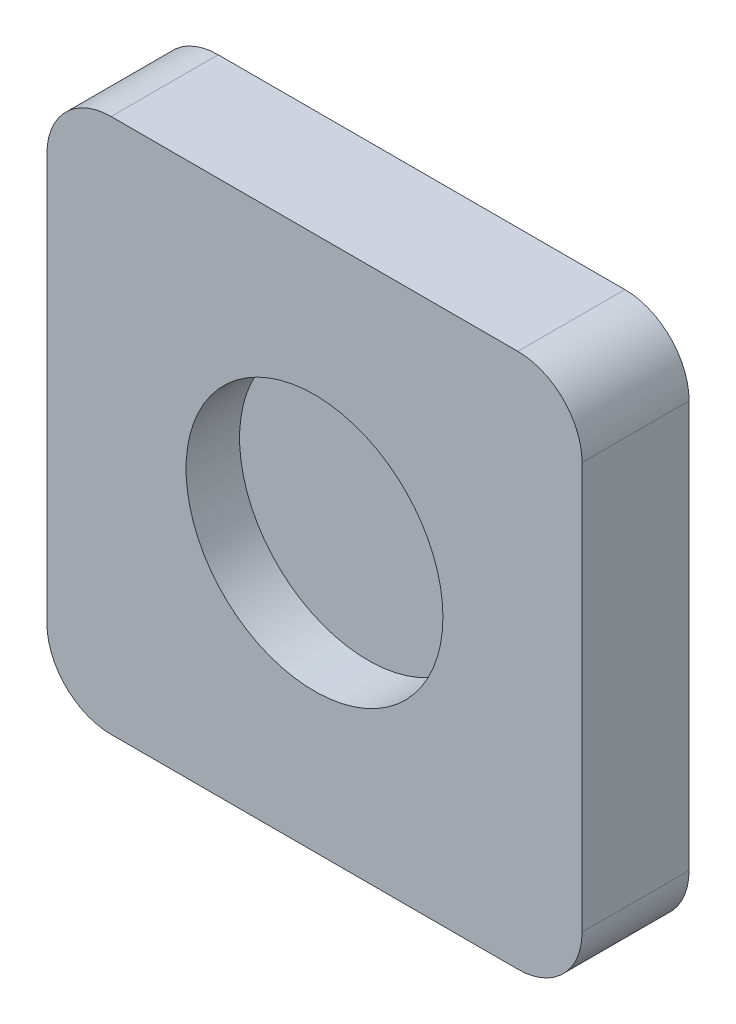
ISO-10303-21;
HEADER;
FILE_DESCRIPTION(('STEP AP214'),'2;1');
FILE_NAME('part.step','',(''),(''),'','','');
FILE_SCHEMA(('AUTOMOTIVE_DESIGN { 1 0 10303 214 1 1 1 1 }'));
ENDSEC;
DATA;
#1=APPLICATION_CONTEXT('core data for automotive mechanical design processes');
#2=APPLICATION_PROTOCOL_DEFINITION('international standard','automotive_design',2000,#1);
#3=PRODUCT_CONTEXT('',#1,'mechanical');
#4=PRODUCT('Part','Part','',(#3));
#5=PRODUCT_RELATED_PRODUCT_CATEGORY('part','',(#4));
#6=PRODUCT_DEFINITION_FORMATION('','',#4);
#7=PRODUCT_DEFINITION_CONTEXT('part definition',#1,'design');
#8=PRODUCT_DEFINITION('design','',#6,#7);
#9=PRODUCT_DEFINITION_SHAPE('','',#8);
#10=(LENGTH_UNIT() NAMED_UNIT(*) SI_UNIT(.MILLI.,.METRE.));
#11=(NAMED_UNIT(*) PLANE_ANGLE_UNIT() SI_UNIT($,.RADIAN.));
#12=(NAMED_UNIT(*) SI_UNIT($,.STERADIAN.) SOLID_ANGLE_UNIT());
#13=UNCERTAINTY_MEASURE_WITH_UNIT(LENGTH_MEASURE(1.E-05),#10,'distance_accuracy_value','');
#14=(GEOMETRIC_REPRESENTATION_CONTEXT(3) GLOBAL_UNCERTAINTY_ASSIGNED_CONTEXT((#13)) GLOBAL_UNIT_ASSIGNED_CONTEXT((#10,
#11,#12)) REPRESENTATION_CONTEXT('',''));
#15=CARTESIAN_POINT('',(0.,0.,0.));
#16=DIRECTION('',(0.,0.,1.));
#17=DIRECTION('',(1.,0.,0.));
#18=AXIS2_PLACEMENT_3D('',#15,#16,#17);
#19=CARTESIAN_POINT('',(-0.095,-0.095,0.05));
#20=DIRECTION('',(0.,0.,-1.));
#21=DIRECTION('',(-1.,0.,0.));
#22=AXIS2_PLACEMENT_3D('',#19,#20,#21);
#23=CYLINDRICAL_SURFACE('',#22,0.03);
#24=CARTESIAN_POINT('',(-0.095,-0.095,0.));
#25=DIRECTION('',(0.,0.,1.));
#26=DIRECTION('',(1.,0.,0.));
#27=AXIS2_PLACEMENT_3D('',#24,#25,#26);
#28=CIRCLE('',#27,0.03);
#29=CARTESIAN_POINT('',(-0.125,-0.095,0.));
#30=VERTEX_POINT('',#29);
#31=CARTESIAN_POINT('',(-0.095,-0.125,0.));
#32=VERTEX_POINT('',#31);
#33=EDGE_CURVE('E139',#30,#32,#28,.T.);
#34=ORIENTED_EDGE('',*,*,#33,.T.);
#35=DIRECTION('',(0.,0.,-1.));
#36=VECTOR('',#35,1.);
#37=CARTESIAN_POINT('',(-0.095,-0.125,0.05));
#38=LINE('',#37,#36);
#39=CARTESIAN_POINT('',(-0.095,-0.125,0.05));
#40=VERTEX_POINT('',#39);
#41=EDGE_CURVE('E11',#40,#32,#38,.T.);
#42=ORIENTED_EDGE('',*,*,#41,.F.);
#43=CARTESIAN_POINT('',(-0.095,-0.095,0.05));
#44=DIRECTION('',(0.,0.,1.));
#45=DIRECTION('',(1.,0.,0.));
#46=AXIS2_PLACEMENT_3D('',#43,#44,#45);
#47=CIRCLE('',#46,0.03);
#48=CARTESIAN_POINT('',(-0.125,-0.095,0.05));
#49=VERTEX_POINT('',#48);
#50=EDGE_CURVE('E162',#49,#40,#47,.T.);
#51=ORIENTED_EDGE('',*,*,#50,.F.);
#52=DIRECTION('',(0.,0.,-1.));
#53=VECTOR('',#52,1.);
#54=CARTESIAN_POINT('',(-0.125,-0.095,0.05));
#55=LINE('',#54,#53);
#56=EDGE_CURVE('E135',#49,#30,#55,.T.);
#57=ORIENTED_EDGE('',*,*,#56,.T.);
#58=EDGE_LOOP('',(#34,#42,#51,#57));
#59=FACE_BOUND('',#58,.T.);
#60=ADVANCED_FACE('F38',(#59),#23,.T.);
#61=CARTESIAN_POINT('',(-0.095,-0.125,0.05));
#62=DIRECTION('',(0.,1.,0.));
#63=DIRECTION('',(0.,0.,1.));
#64=AXIS2_PLACEMENT_3D('',#61,#62,#63);
#65=PLANE('',#64);
#66=DIRECTION('',(1.,0.,0.));
#67=VECTOR('',#66,1.);
#68=CARTESIAN_POINT('',(-0.095,-0.125,0.));
#69=LINE('',#68,#67);
#70=CARTESIAN_POINT('',(0.095,-0.125,0.));
#71=VERTEX_POINT('',#70);
#72=EDGE_CURVE('E143',#32,#71,#69,.T.);
#73=ORIENTED_EDGE('',*,*,#72,.T.);
#74=DIRECTION('',(0.,0.,-1.));
#75=VECTOR('',#74,1.);
#76=CARTESIAN_POINT('',(0.095,-0.125,0.05));
#77=LINE('',#76,#75);
#78=CARTESIAN_POINT('',(0.095,-0.125,0.05));
#79=VERTEX_POINT('',#78);
#80=EDGE_CURVE('E47',#79,#71,#77,.T.);
#81=ORIENTED_EDGE('',*,*,#80,.F.);
#82=DIRECTION('',(1.,0.,0.));
#83=VECTOR('',#82,1.);
#84=CARTESIAN_POINT('',(-0.095,-0.125,0.05));
#85=LINE('',#84,#83);
#86=EDGE_CURVE('E98',#40,#79,#85,.T.);
#87=ORIENTED_EDGE('',*,*,#86,.F.);
#88=ORIENTED_EDGE('',*,*,#41,.T.);
#89=EDGE_LOOP('',(#73,#81,#87,#88));
#90=FACE_BOUND('',#89,.T.);
#91=ADVANCED_FACE('F234',(#90),#65,.F.);
#92=CARTESIAN_POINT('',(0.095,-0.095,0.05));
#93=DIRECTION('',(0.,0.,-1.));
#94=DIRECTION('',(-1.,0.,0.));
#95=AXIS2_PLACEMENT_3D('',#92,#93,#94);
#96=CYLINDRICAL_SURFACE('',#95,0.03);
#97=CARTESIAN_POINT('',(0.095,-0.095,0.));
#98=DIRECTION('',(0.,0.,1.));
#99=DIRECTION('',(1.,0.,0.));
#100=AXIS2_PLACEMENT_3D('',#97,#98,#99);
#101=CIRCLE('',#100,0.03);
#102=CARTESIAN_POINT('',(0.125,-0.095,0.));
#103=VERTEX_POINT('',#102);
#104=EDGE_CURVE('E147',#71,#103,#101,.T.);
#105=ORIENTED_EDGE('',*,*,#104,.T.);
#106=DIRECTION('',(0.,0.,-1.));
#107=VECTOR('',#106,1.);
#108=CARTESIAN_POINT('',(0.125,-0.095,0.05));
#109=LINE('',#108,#107);
#110=CARTESIAN_POINT('',(0.125,-0.095,0.05));
#111=VERTEX_POINT('',#110);
#112=EDGE_CURVE('E173',#111,#103,#109,.T.);
#113=ORIENTED_EDGE('',*,*,#112,.F.);
#114=CARTESIAN_POINT('',(0.095,-0.095,0.05));
#115=DIRECTION('',(0.,0.,1.));
#116=DIRECTION('',(1.,0.,0.));
#117=AXIS2_PLACEMENT_3D('',#114,#115,#116);
#118=CIRCLE('',#117,0.03);
#119=EDGE_CURVE('E183',#79,#111,#118,.T.);
#120=ORIENTED_EDGE('',*,*,#119,.F.);
#121=ORIENTED_EDGE('',*,*,#80,.T.);
#122=EDGE_LOOP('',(#105,#113,#120,#121));
#123=FACE_BOUND('',#122,.T.);
#124=ADVANCED_FACE('F181',(#123),#96,.T.);
#125=CARTESIAN_POINT('',(0.125,-0.095,0.05));
#126=DIRECTION('',(-1.,0.,0.));
#127=DIRECTION('',(0.,0.,1.));
#128=AXIS2_PLACEMENT_3D('',#125,#126,#127);
#129=PLANE('',#128);
#130=DIRECTION('',(0.,1.,0.));
#131=VECTOR('',#130,1.);
#132=CARTESIAN_POINT('',(0.125,-0.095,0.));
#133=LINE('',#132,#131);
#134=CARTESIAN_POINT('',(0.125,0.095,0.));
#135=VERTEX_POINT('',#134);
#136=EDGE_CURVE('E150',#103,#135,#133,.T.);
#137=ORIENTED_EDGE('',*,*,#136,.T.);
#138=DIRECTION('',(0.,0.,-1.));
#139=VECTOR('',#138,1.);
#140=CARTESIAN_POINT('',(0.125,0.095,0.05));
#141=LINE('',#140,#139);
#142=CARTESIAN_POINT('',(0.125,0.095,0.05));
#143=VERTEX_POINT('',#142);
#144=EDGE_CURVE('E169',#143,#135,#141,.T.);
#145=ORIENTED_EDGE('',*,*,#144,.F.);
#146=DIRECTION('',(0.,1.,0.));
#147=VECTOR('',#146,1.);
#148=CARTESIAN_POINT('',(0.125,-0.095,0.05));
#149=LINE('',#148,#147);
#150=EDGE_CURVE('E196',#111,#143,#149,.T.);
#151=ORIENTED_EDGE('',*,*,#150,.F.);
#152=ORIENTED_EDGE('',*,*,#112,.T.);
#153=EDGE_LOOP('',(#137,#145,#151,#152));
#154=FACE_BOUND('',#153,.T.);
#155=ADVANCED_FACE('F191',(#154),#129,.F.);
#156=CARTESIAN_POINT('',(0.095,0.095,0.05));
#157=DIRECTION('',(0.,0.,-1.));
#158=DIRECTION('',(-1.,0.,0.));
#159=AXIS2_PLACEMENT_3D('',#156,#157,#158);
#160=CYLINDRICAL_SURFACE('',#159,0.03);
#161=CARTESIAN_POINT('',(0.095,0.095,0.));
#162=DIRECTION('',(0.,0.,1.));
#163=DIRECTION('',(-1.,0.,0.));
#164=AXIS2_PLACEMENT_3D('',#161,#162,#163);
#165=CIRCLE('',#164,0.03);
#166=CARTESIAN_POINT('',(0.095,0.125,0.));
#167=VERTEX_POINT('',#166);
#168=EDGE_CURVE('E153',#135,#167,#165,.T.);
#169=ORIENTED_EDGE('',*,*,#168,.T.);
#170=DIRECTION('',(0.,0.,-1.));
#171=VECTOR('',#170,1.);
#172=CARTESIAN_POINT('',(0.095,0.125,0.05));
#173=LINE('',#172,#171);
#174=CARTESIAN_POINT('',(0.095,0.125,0.05));
#175=VERTEX_POINT('',#174);
#176=EDGE_CURVE('E128',#175,#167,#173,.T.);
#177=ORIENTED_EDGE('',*,*,#176,.F.);
#178=CARTESIAN_POINT('',(0.095,0.095,0.05));
#179=DIRECTION('',(0.,0.,1.));
#180=DIRECTION('',(-1.,0.,0.));
#181=AXIS2_PLACEMENT_3D('',#178,#179,#180);
#182=CIRCLE('',#181,0.03);
#183=EDGE_CURVE('E117',#143,#175,#182,.T.);
#184=ORIENTED_EDGE('',*,*,#183,.F.);
#185=ORIENTED_EDGE('',*,*,#144,.T.);
#186=EDGE_LOOP('',(#169,#177,#184,#185));
#187=FACE_BOUND('',#186,.T.);
#188=ADVANCED_FACE('F194',(#187),#160,.T.);
#189=CARTESIAN_POINT('',(-0.095,0.125,0.05));
#190=DIRECTION('',(0.,-1.,0.));
#191=DIRECTION('',(0.,0.,-1.));
#192=AXIS2_PLACEMENT_3D('',#189,#190,#191);
#193=PLANE('',#192);
#194=DIRECTION('',(-1.,0.,0.));
#195=VECTOR('',#194,1.);
#196=CARTESIAN_POINT('',(-0.095,0.125,0.));
#197=LINE('',#196,#195);
#198=CARTESIAN_POINT('',(-0.095,0.125,0.));
#199=VERTEX_POINT('',#198);
#200=EDGE_CURVE('E126',#167,#199,#197,.T.);
#201=ORIENTED_EDGE('',*,*,#200,.T.);
#202=DIRECTION('',(0.,0.,-1.));
#203=VECTOR('',#202,1.);
#204=CARTESIAN_POINT('',(-0.095,0.125,0.05));
#205=LINE('',#204,#203);
#206=CARTESIAN_POINT('',(-0.095,0.125,0.05));
#207=VERTEX_POINT('',#206);
#208=EDGE_CURVE('E123',#207,#199,#205,.T.);
#209=ORIENTED_EDGE('',*,*,#208,.F.);
#210=DIRECTION('',(-1.,0.,0.));
#211=VECTOR('',#210,1.);
#212=CARTESIAN_POINT('',(-0.095,0.125,0.05));
#213=LINE('',#212,#211);
#214=EDGE_CURVE('E111',#175,#207,#213,.T.);
#215=ORIENTED_EDGE('',*,*,#214,.F.);
#216=ORIENTED_EDGE('',*,*,#176,.T.);
#217=EDGE_LOOP('',(#201,#209,#215,#216));
#218=FACE_BOUND('',#217,.T.);
#219=ADVANCED_FACE('F124',(#218),#193,.F.);
#220=CARTESIAN_POINT('',(-0.095,0.095,0.05));
#221=DIRECTION('',(0.,0.,-1.));
#222=DIRECTION('',(-1.,0.,0.));
#223=AXIS2_PLACEMENT_3D('',#220,#221,#222);
#224=CYLINDRICAL_SURFACE('',#223,0.03);
#225=CARTESIAN_POINT('',(-0.095,0.095,0.));
#226=DIRECTION('',(0.,0.,1.));
#227=DIRECTION('',(1.,0.,0.));
#228=AXIS2_PLACEMENT_3D('',#225,#226,#227);
#229=CIRCLE('',#228,0.03);
#230=CARTESIAN_POINT('',(-0.125,0.095,0.));
#231=VERTEX_POINT('',#230);
#232=EDGE_CURVE('E84',#199,#231,#229,.T.);
#233=ORIENTED_EDGE('',*,*,#232,.T.);
#234=DIRECTION('',(0.,0.,-1.));
#235=VECTOR('',#234,1.);
#236=CARTESIAN_POINT('',(-0.125,0.095,0.05));
#237=LINE('',#236,#235);
#238=CARTESIAN_POINT('',(-0.125,0.095,0.05));
#239=VERTEX_POINT('',#238);
#240=EDGE_CURVE('E129',#239,#231,#237,.T.);
#241=ORIENTED_EDGE('',*,*,#240,.F.);
#242=CARTESIAN_POINT('',(-0.095,0.095,0.05));
#243=DIRECTION('',(0.,0.,1.));
#244=DIRECTION('',(1.,0.,0.));
#245=AXIS2_PLACEMENT_3D('',#242,#243,#244);
#246=CIRCLE('',#245,0.03);
#247=EDGE_CURVE('E115',#207,#239,#246,.T.);
#248=ORIENTED_EDGE('',*,*,#247,.F.);
#249=ORIENTED_EDGE('',*,*,#208,.T.);
#250=EDGE_LOOP('',(#233,#241,#248,#249));
#251=FACE_BOUND('',#250,.T.);
#252=ADVANCED_FACE('F131',(#251),#224,.T.);
#253=CARTESIAN_POINT('',(-0.125,-0.095,0.05));
#254=DIRECTION('',(1.,0.,0.));
#255=DIRECTION('',(0.,0.,-1.));
#256=AXIS2_PLACEMENT_3D('',#253,#254,#255);
#257=PLANE('',#256);
#258=DIRECTION('',(0.,-1.,0.));
#259=VECTOR('',#258,1.);
#260=CARTESIAN_POINT('',(-0.125,-0.095,0.));
#261=LINE('',#260,#259);
#262=EDGE_CURVE('E90',#231,#30,#261,.T.);
#263=ORIENTED_EDGE('',*,*,#262,.T.);
#264=ORIENTED_EDGE('',*,*,#56,.F.);
#265=DIRECTION('',(0.,-1.,0.));
#266=VECTOR('',#265,1.);
#267=CARTESIAN_POINT('',(-0.125,-0.095,0.05));
#268=LINE('',#267,#266);
#269=EDGE_CURVE('E55',#239,#49,#268,.T.);
#270=ORIENTED_EDGE('',*,*,#269,.F.);
#271=ORIENTED_EDGE('',*,*,#240,.T.);
#272=EDGE_LOOP('',(#263,#264,#270,#271));
#273=FACE_BOUND('',#272,.T.);
#274=ADVANCED_FACE('F223',(#273),#257,.F.);
#275=CARTESIAN_POINT('',(-0.095,-0.095,0.05));
#276=DIRECTION('',(0.,0.,1.));
#277=DIRECTION('',(1.,0.,0.));
#278=AXIS2_PLACEMENT_3D('',#275,#276,#277);
#279=PLANE('',#278);
#280=CARTESIAN_POINT('',(0.,0.,0.05));
#281=DIRECTION('',(0.,0.,1.));
#282=DIRECTION('',(1.,0.,0.));
#283=AXIS2_PLACEMENT_3D('',#280,#281,#282);
#284=CIRCLE('',#283,0.06);
#285=CARTESIAN_POINT('',(0.06,0.,0.05));
#286=VERTEX_POINT('',#285);
#287=EDGE_CURVE('E206',#286,#286,#284,.T.);
#288=ORIENTED_EDGE('',*,*,#287,.F.);
#289=EDGE_LOOP('',(#288));
#290=FACE_BOUND('',#289,.T.);
#291=ORIENTED_EDGE('',*,*,#50,.T.);
#292=ORIENTED_EDGE('',*,*,#86,.T.);
#293=ORIENTED_EDGE('',*,*,#119,.T.);
#294=ORIENTED_EDGE('',*,*,#150,.T.);
#295=ORIENTED_EDGE('',*,*,#183,.T.);
#296=ORIENTED_EDGE('',*,*,#214,.T.);
#297=ORIENTED_EDGE('',*,*,#247,.T.);
#298=ORIENTED_EDGE('',*,*,#269,.T.);
#299=EDGE_LOOP('',(#291,#292,#293,#294,#295,#296,#297,#298));
#300=FACE_BOUND('',#299,.T.);
#301=ADVANCED_FACE('F113',(#290,#300),#279,.T.);
#302=CARTESIAN_POINT('',(-0.095,-0.095,0.));
#303=DIRECTION('',(0.,0.,1.));
#304=DIRECTION('',(1.,0.,0.));
#305=AXIS2_PLACEMENT_3D('',#302,#303,#304);
#306=PLANE('',#305);
#307=ORIENTED_EDGE('',*,*,#33,.F.);
#308=ORIENTED_EDGE('',*,*,#262,.F.);
#309=ORIENTED_EDGE('',*,*,#232,.F.);
#310=ORIENTED_EDGE('',*,*,#200,.F.);
#311=ORIENTED_EDGE('',*,*,#168,.F.);
#312=ORIENTED_EDGE('',*,*,#136,.F.);
#313=ORIENTED_EDGE('',*,*,#104,.F.);
#314=ORIENTED_EDGE('',*,*,#72,.F.);
#315=EDGE_LOOP('',(#307,#308,#309,#310,#311,#312,#313,#314));
#316=FACE_BOUND('',#315,.T.);
#317=ADVANCED_FACE('F187',(#316),#306,.F.);
#318=CARTESIAN_POINT('',(0.,0.,0.025));
#319=DIRECTION('',(0.,0.,1.));
#320=DIRECTION('',(1.,0.,0.));
#321=AXIS2_PLACEMENT_3D('',#318,#319,#320);
#322=CYLINDRICAL_SURFACE('',#321,0.06);
#323=CARTESIAN_POINT('',(0.,0.,0.025));
#324=DIRECTION('',(0.,0.,1.));
#325=DIRECTION('',(1.,0.,0.));
#326=AXIS2_PLACEMENT_3D('',#323,#324,#325);
#327=CIRCLE('',#326,0.06);
#328=CARTESIAN_POINT('',(0.06,0.,0.025));
#329=VERTEX_POINT('',#328);
#330=EDGE_CURVE('E144',#329,#329,#327,.T.);
#331=ORIENTED_EDGE('',*,*,#330,.F.);
#332=EDGE_LOOP('',(#331));
#333=FACE_BOUND('',#332,.T.);
#334=ORIENTED_EDGE('',*,*,#287,.T.);
#335=EDGE_LOOP('',(#334));
#336=FACE_BOUND('',#335,.T.);
#337=ADVANCED_FACE('F216',(#333,#336),#322,.F.);
#338=CARTESIAN_POINT('',(0.,0.,0.025));
#339=DIRECTION('',(0.,0.,1.));
#340=DIRECTION('',(1.,0.,0.));
#341=AXIS2_PLACEMENT_3D('',#338,#339,#340);
#342=PLANE('',#341);
#343=ORIENTED_EDGE('',*,*,#330,.T.);
#344=EDGE_LOOP('',(#343));
#345=FACE_BOUND('',#344,.T.);
#346=ADVANCED_FACE('F214',(#345),#342,.T.);
#347=CLOSED_SHELL('',(#60,#91,#124,#155,#188,#219,#252,#274,#301,#317,#337,#346));
#348=MANIFOLD_SOLID_BREP('B2',#347);
#349=ADVANCED_BREP_SHAPE_REPRESENTATION('',(#18,#348),#14);
#350=SHAPE_DEFINITION_REPRESENTATION(#9,#349);
ENDSEC;
END-ISO-10303-21;
